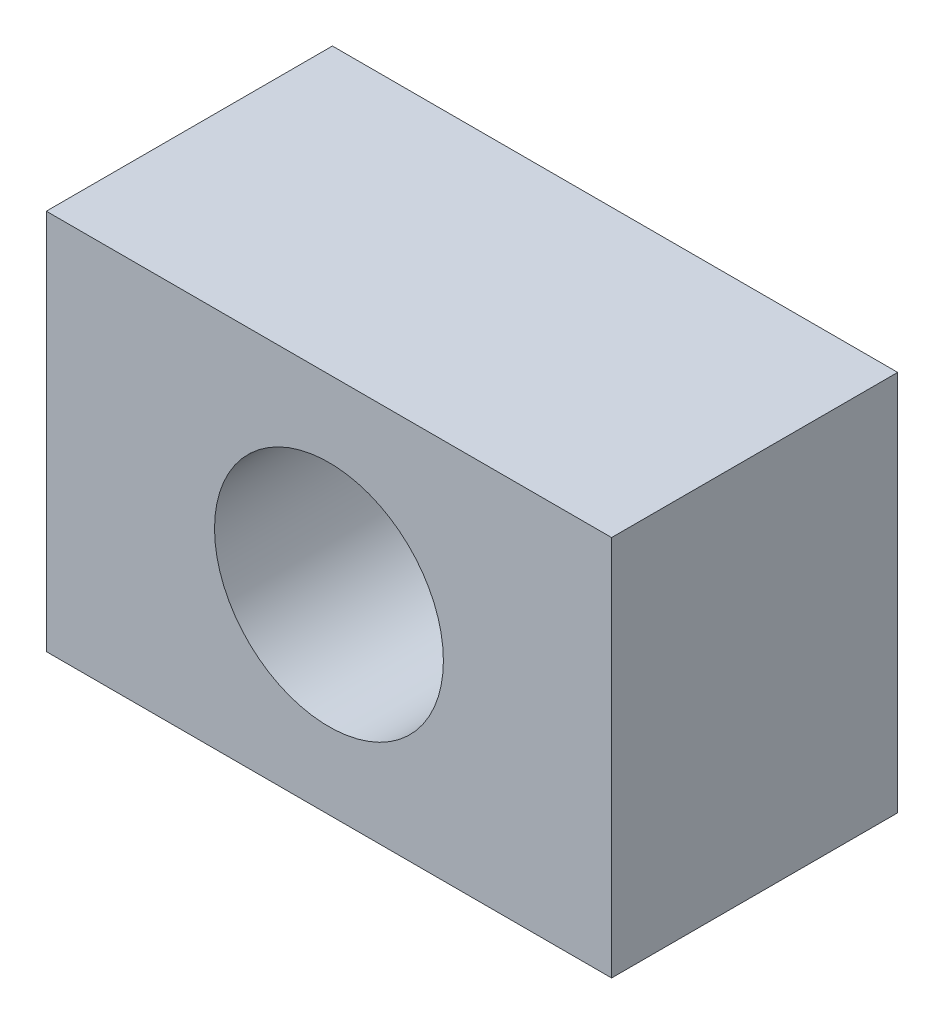
ISO-10303-21;
HEADER;
FILE_DESCRIPTION(('STEP AP214'),'2;1');
FILE_NAME('part.step','',(''),(''),'','','');
FILE_SCHEMA(('AUTOMOTIVE_DESIGN { 1 0 10303 214 1 1 1 1 }'));
ENDSEC;
DATA;
#1=APPLICATION_CONTEXT('core data for automotive mechanical design processes');
#2=APPLICATION_PROTOCOL_DEFINITION('international standard','automotive_design',2000,#1);
#3=PRODUCT_CONTEXT('',#1,'mechanical');
#4=PRODUCT('Part','Part','',(#3));
#5=PRODUCT_RELATED_PRODUCT_CATEGORY('part','',(#4));
#6=PRODUCT_DEFINITION_FORMATION('','',#4);
#7=PRODUCT_DEFINITION_CONTEXT('part definition',#1,'design');
#8=PRODUCT_DEFINITION('design','',#6,#7);
#9=PRODUCT_DEFINITION_SHAPE('','',#8);
#10=(LENGTH_UNIT() NAMED_UNIT(*) SI_UNIT(.MILLI.,.METRE.));
#11=(NAMED_UNIT(*) PLANE_ANGLE_UNIT() SI_UNIT($,.RADIAN.));
#12=(NAMED_UNIT(*) SI_UNIT($,.STERADIAN.) SOLID_ANGLE_UNIT());
#13=UNCERTAINTY_MEASURE_WITH_UNIT(LENGTH_MEASURE(1.E-05),#10,'distance_accuracy_value','');
#14=(GEOMETRIC_REPRESENTATION_CONTEXT(3) GLOBAL_UNCERTAINTY_ASSIGNED_CONTEXT((#13)) GLOBAL_UNIT_ASSIGNED_CONTEXT((#10,
#11,#12)) REPRESENTATION_CONTEXT('',''));
#15=CARTESIAN_POINT('',(0.,0.,0.));
#16=DIRECTION('',(0.,0.,1.));
#17=DIRECTION('',(1.,0.,0.));
#18=AXIS2_PLACEMENT_3D('',#15,#16,#17);
#19=CARTESIAN_POINT('',(0.,0.,15.));
#20=DIRECTION('',(0.,0.,-1.));
#21=DIRECTION('',(-1.,0.,0.));
#22=AXIS2_PLACEMENT_3D('',#19,#20,#21);
#23=PLANE('',#22);
#24=DIRECTION('',(0.,1.,0.));
#25=VECTOR('',#24,1.);
#26=CARTESIAN_POINT('',(14.82,-10.,15.));
#27=LINE('',#26,#25);
#28=CARTESIAN_POINT('',(14.82,-10.,15.));
#29=VERTEX_POINT('',#28);
#30=CARTESIAN_POINT('',(14.82,10.,15.));
#31=VERTEX_POINT('',#30);
#32=EDGE_CURVE('E88',#29,#31,#27,.T.);
#33=ORIENTED_EDGE('',*,*,#32,.T.);
#34=DIRECTION('',(-1.,0.,0.));
#35=VECTOR('',#34,1.);
#36=CARTESIAN_POINT('',(-14.82,10.,15.));
#37=LINE('',#36,#35);
#38=CARTESIAN_POINT('',(-14.82,10.,15.));
#39=VERTEX_POINT('',#38);
#40=EDGE_CURVE('E83',#31,#39,#37,.T.);
#41=ORIENTED_EDGE('',*,*,#40,.T.);
#42=DIRECTION('',(0.,-1.,0.));
#43=VECTOR('',#42,1.);
#44=CARTESIAN_POINT('',(-14.82,-10.,15.));
#45=LINE('',#44,#43);
#46=CARTESIAN_POINT('',(-14.82,-10.,15.));
#47=VERTEX_POINT('',#46);
#48=EDGE_CURVE('E86',#39,#47,#45,.T.);
#49=ORIENTED_EDGE('',*,*,#48,.T.);
#50=DIRECTION('',(1.,0.,0.));
#51=VECTOR('',#50,1.);
#52=CARTESIAN_POINT('',(-14.82,-10.,15.));
#53=LINE('',#52,#51);
#54=EDGE_CURVE('E53',#47,#29,#53,.T.);
#55=ORIENTED_EDGE('',*,*,#54,.T.);
#56=EDGE_LOOP('',(#33,#41,#49,#55));
#57=FACE_BOUND('',#56,.T.);
#58=CARTESIAN_POINT('',(0.,0.,15.));
#59=DIRECTION('',(0.,0.,1.));
#60=DIRECTION('',(1.,0.,0.));
#61=AXIS2_PLACEMENT_3D('',#58,#59,#60);
#62=CIRCLE('',#61,6.);
#63=CARTESIAN_POINT('',(6.,0.,15.));
#64=VERTEX_POINT('',#63);
#65=EDGE_CURVE('E103',#64,#64,#62,.T.);
#66=ORIENTED_EDGE('',*,*,#65,.F.);
#67=EDGE_LOOP('',(#66));
#68=FACE_BOUND('',#67,.T.);
#69=ADVANCED_FACE('F36',(#57,#68),#23,.F.);
#70=CARTESIAN_POINT('',(0.,0.,0.));
#71=DIRECTION('',(0.,0.,-1.));
#72=DIRECTION('',(-1.,0.,0.));
#73=AXIS2_PLACEMENT_3D('',#70,#71,#72);
#74=PLANE('',#73);
#75=DIRECTION('',(0.,1.,0.));
#76=VECTOR('',#75,1.);
#77=CARTESIAN_POINT('',(14.82,-10.,0.));
#78=LINE('',#77,#76);
#79=CARTESIAN_POINT('',(14.82,-10.,0.));
#80=VERTEX_POINT('',#79);
#81=CARTESIAN_POINT('',(14.82,10.,0.));
#82=VERTEX_POINT('',#81);
#83=EDGE_CURVE('E100',#80,#82,#78,.T.);
#84=ORIENTED_EDGE('',*,*,#83,.F.);
#85=DIRECTION('',(1.,0.,0.));
#86=VECTOR('',#85,1.);
#87=CARTESIAN_POINT('',(-14.82,-10.,0.));
#88=LINE('',#87,#86);
#89=CARTESIAN_POINT('',(-14.82,-10.,0.));
#90=VERTEX_POINT('',#89);
#91=EDGE_CURVE('E76',#90,#80,#88,.T.);
#92=ORIENTED_EDGE('',*,*,#91,.F.);
#93=DIRECTION('',(0.,-1.,0.));
#94=VECTOR('',#93,1.);
#95=CARTESIAN_POINT('',(-14.82,-10.,0.));
#96=LINE('',#95,#94);
#97=CARTESIAN_POINT('',(-14.82,10.,0.));
#98=VERTEX_POINT('',#97);
#99=EDGE_CURVE('E70',#98,#90,#96,.T.);
#100=ORIENTED_EDGE('',*,*,#99,.F.);
#101=DIRECTION('',(-1.,0.,0.));
#102=VECTOR('',#101,1.);
#103=CARTESIAN_POINT('',(-14.82,10.,0.));
#104=LINE('',#103,#102);
#105=EDGE_CURVE('E92',#82,#98,#104,.T.);
#106=ORIENTED_EDGE('',*,*,#105,.F.);
#107=EDGE_LOOP('',(#84,#92,#100,#106));
#108=FACE_BOUND('',#107,.T.);
#109=CARTESIAN_POINT('',(0.,0.,0.));
#110=DIRECTION('',(0.,0.,1.));
#111=DIRECTION('',(1.,0.,0.));
#112=AXIS2_PLACEMENT_3D('',#109,#110,#111);
#113=CIRCLE('',#112,6.);
#114=CARTESIAN_POINT('',(6.,0.,0.));
#115=VERTEX_POINT('',#114);
#116=EDGE_CURVE('E115',#115,#115,#113,.T.);
#117=ORIENTED_EDGE('',*,*,#116,.T.);
#118=EDGE_LOOP('',(#117));
#119=FACE_BOUND('',#118,.T.);
#120=ADVANCED_FACE('F111',(#108,#119),#74,.T.);
#121=CARTESIAN_POINT('',(14.82,-10.,15.));
#122=DIRECTION('',(-1.,0.,0.));
#123=DIRECTION('',(0.,0.,1.));
#124=AXIS2_PLACEMENT_3D('',#121,#122,#123);
#125=PLANE('',#124);
#126=ORIENTED_EDGE('',*,*,#83,.T.);
#127=DIRECTION('',(0.,0.,-1.));
#128=VECTOR('',#127,1.);
#129=CARTESIAN_POINT('',(14.82,10.,15.));
#130=LINE('',#129,#128);
#131=EDGE_CURVE('E11',#31,#82,#130,.T.);
#132=ORIENTED_EDGE('',*,*,#131,.F.);
#133=ORIENTED_EDGE('',*,*,#32,.F.);
#134=DIRECTION('',(0.,0.,-1.));
#135=VECTOR('',#134,1.);
#136=CARTESIAN_POINT('',(14.82,-10.,15.));
#137=LINE('',#136,#135);
#138=EDGE_CURVE('E96',#29,#80,#137,.T.);
#139=ORIENTED_EDGE('',*,*,#138,.T.);
#140=EDGE_LOOP('',(#126,#132,#133,#139));
#141=FACE_BOUND('',#140,.T.);
#142=ADVANCED_FACE('F38',(#141),#125,.F.);
#143=CARTESIAN_POINT('',(-14.82,10.,15.));
#144=DIRECTION('',(0.,-1.,0.));
#145=DIRECTION('',(0.,0.,-1.));
#146=AXIS2_PLACEMENT_3D('',#143,#144,#145);
#147=PLANE('',#146);
#148=ORIENTED_EDGE('',*,*,#105,.T.);
#149=DIRECTION('',(0.,0.,-1.));
#150=VECTOR('',#149,1.);
#151=CARTESIAN_POINT('',(-14.82,10.,15.));
#152=LINE('',#151,#150);
#153=EDGE_CURVE('E45',#39,#98,#152,.T.);
#154=ORIENTED_EDGE('',*,*,#153,.F.);
#155=ORIENTED_EDGE('',*,*,#40,.F.);
#156=ORIENTED_EDGE('',*,*,#131,.T.);
#157=EDGE_LOOP('',(#148,#154,#155,#156));
#158=FACE_BOUND('',#157,.T.);
#159=ADVANCED_FACE('F91',(#158),#147,.F.);
#160=CARTESIAN_POINT('',(-14.82,-10.,15.));
#161=DIRECTION('',(1.,0.,0.));
#162=DIRECTION('',(0.,0.,-1.));
#163=AXIS2_PLACEMENT_3D('',#160,#161,#162);
#164=PLANE('',#163);
#165=ORIENTED_EDGE('',*,*,#99,.T.);
#166=DIRECTION('',(0.,0.,-1.));
#167=VECTOR('',#166,1.);
#168=CARTESIAN_POINT('',(-14.82,-10.,15.));
#169=LINE('',#168,#167);
#170=EDGE_CURVE('E93',#47,#90,#169,.T.);
#171=ORIENTED_EDGE('',*,*,#170,.F.);
#172=ORIENTED_EDGE('',*,*,#48,.F.);
#173=ORIENTED_EDGE('',*,*,#153,.T.);
#174=EDGE_LOOP('',(#165,#171,#172,#173));
#175=FACE_BOUND('',#174,.T.);
#176=ADVANCED_FACE('F94',(#175),#164,.F.);
#177=CARTESIAN_POINT('',(-14.82,-10.,15.));
#178=DIRECTION('',(0.,1.,0.));
#179=DIRECTION('',(0.,0.,1.));
#180=AXIS2_PLACEMENT_3D('',#177,#178,#179);
#181=PLANE('',#180);
#182=ORIENTED_EDGE('',*,*,#91,.T.);
#183=ORIENTED_EDGE('',*,*,#138,.F.);
#184=ORIENTED_EDGE('',*,*,#54,.F.);
#185=ORIENTED_EDGE('',*,*,#170,.T.);
#186=EDGE_LOOP('',(#182,#183,#184,#185));
#187=FACE_BOUND('',#186,.T.);
#188=ADVANCED_FACE('F108',(#187),#181,.F.);
#189=CARTESIAN_POINT('',(0.,0.,15.));
#190=DIRECTION('',(0.,0.,-1.));
#191=DIRECTION('',(-1.,0.,0.));
#192=AXIS2_PLACEMENT_3D('',#189,#190,#191);
#193=CYLINDRICAL_SURFACE('',#192,6.);
#194=ORIENTED_EDGE('',*,*,#65,.T.);
#195=EDGE_LOOP('',(#194));
#196=FACE_BOUND('',#195,.T.);
#197=ORIENTED_EDGE('',*,*,#116,.F.);
#198=EDGE_LOOP('',(#197));
#199=FACE_BOUND('',#198,.T.);
#200=ADVANCED_FACE('F121',(#196,#199),#193,.F.);
#201=CLOSED_SHELL('',(#69,#120,#142,#159,#176,#188,#200));
#202=MANIFOLD_SOLID_BREP('B2',#201);
#203=ADVANCED_BREP_SHAPE_REPRESENTATION('',(#18,#202),#14);
#204=SHAPE_DEFINITION_REPRESENTATION(#9,#203);
ENDSEC;
END-ISO-10303-21;
